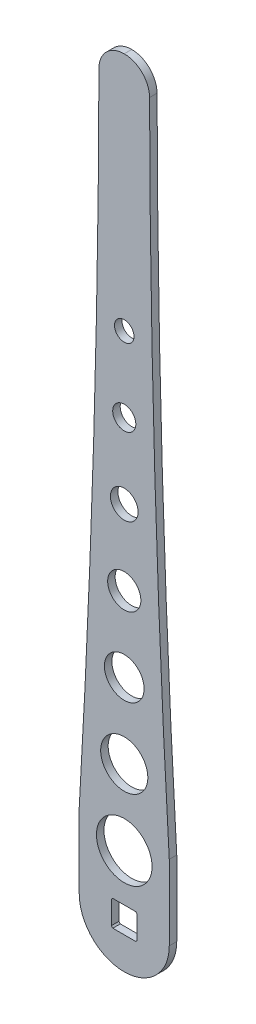
ISO-10303-21;
HEADER;
FILE_DESCRIPTION(('STEP AP214'),'2;1');
FILE_NAME('part.step','',(''),(''),'','','');
FILE_SCHEMA(('AUTOMOTIVE_DESIGN { 1 0 10303 214 1 1 1 1 }'));
ENDSEC;
DATA;
#1=APPLICATION_CONTEXT('core data for automotive mechanical design processes');
#2=APPLICATION_PROTOCOL_DEFINITION('international standard','automotive_design',2000,#1);
#3=PRODUCT_CONTEXT('',#1,'mechanical');
#4=PRODUCT('Part','Part','',(#3));
#5=PRODUCT_RELATED_PRODUCT_CATEGORY('part','',(#4));
#6=PRODUCT_DEFINITION_FORMATION('','',#4);
#7=PRODUCT_DEFINITION_CONTEXT('part definition',#1,'design');
#8=PRODUCT_DEFINITION('design','',#6,#7);
#9=PRODUCT_DEFINITION_SHAPE('','',#8);
#10=(LENGTH_UNIT() NAMED_UNIT(*) SI_UNIT(.MILLI.,.METRE.));
#11=(NAMED_UNIT(*) PLANE_ANGLE_UNIT() SI_UNIT($,.RADIAN.));
#12=(NAMED_UNIT(*) SI_UNIT($,.STERADIAN.) SOLID_ANGLE_UNIT());
#13=UNCERTAINTY_MEASURE_WITH_UNIT(LENGTH_MEASURE(1.E-05),#10,'distance_accuracy_value','');
#14=(GEOMETRIC_REPRESENTATION_CONTEXT(3) GLOBAL_UNCERTAINTY_ASSIGNED_CONTEXT((#13)) GLOBAL_UNIT_ASSIGNED_CONTEXT((#10,
#11,#12)) REPRESENTATION_CONTEXT('',''));
#15=CARTESIAN_POINT('',(0.,0.,0.));
#16=DIRECTION('',(0.,0.,1.));
#17=DIRECTION('',(1.,0.,0.));
#18=AXIS2_PLACEMENT_3D('',#15,#16,#17);
#19=CARTESIAN_POINT('',(-8.6,8.6,-5.));
#20=DIRECTION('',(-1.,0.,0.));
#21=DIRECTION('',(0.,-1.,0.));
#22=AXIS2_PLACEMENT_3D('',#19,#20,#21);
#23=PLANE('',#22);
#24=DIRECTION('',(0.,0.,1.));
#25=VECTOR('',#24,1.);
#26=CARTESIAN_POINT('',(-8.6,-7.63478879865055,-49.424357741048));
#27=LINE('',#26,#25);
#28=CARTESIAN_POINT('',(-8.6,-7.63478879865055,0.));
#29=VERTEX_POINT('',#28);
#30=CARTESIAN_POINT('',(-8.6,-7.63478879865055,5.));
#31=VERTEX_POINT('',#30);
#32=EDGE_CURVE('E256',#29,#31,#27,.T.);
#33=ORIENTED_EDGE('',*,*,#32,.F.);
#34=DIRECTION('',(0.,-1.,0.));
#35=VECTOR('',#34,1.);
#36=CARTESIAN_POINT('',(-8.6,0.,0.));
#37=LINE('',#36,#35);
#38=CARTESIAN_POINT('',(-8.6,7.63478879865055,0.));
#39=VERTEX_POINT('',#38);
#40=EDGE_CURVE('E187',#39,#29,#37,.T.);
#41=ORIENTED_EDGE('',*,*,#40,.F.);
#42=DIRECTION('',(0.,0.,1.));
#43=VECTOR('',#42,1.);
#44=CARTESIAN_POINT('',(-8.6,7.63478879865055,-49.424357741048));
#45=LINE('',#44,#43);
#46=CARTESIAN_POINT('',(-8.6,7.63478879865055,5.));
#47=VERTEX_POINT('',#46);
#48=EDGE_CURVE('E254',#47,#39,#45,.F.);
#49=ORIENTED_EDGE('',*,*,#48,.F.);
#50=DIRECTION('',(0.,-1.,0.));
#51=VECTOR('',#50,1.);
#52=CARTESIAN_POINT('',(-8.6,8.6,5.));
#53=LINE('',#52,#51);
#54=EDGE_CURVE('E258',#47,#31,#53,.T.);
#55=ORIENTED_EDGE('',*,*,#54,.T.);
#56=EDGE_LOOP('',(#33,#41,#49,#55));
#57=FACE_BOUND('',#56,.T.);
#58=ADVANCED_FACE('F41',(#57),#23,.F.);
#59=CARTESIAN_POINT('',(8.6,8.6,-5.));
#60=DIRECTION('',(0.,1.,0.));
#61=DIRECTION('',(-1.,0.,0.));
#62=AXIS2_PLACEMENT_3D('',#59,#60,#61);
#63=PLANE('',#62);
#64=DIRECTION('',(0.,0.,1.));
#65=VECTOR('',#64,1.);
#66=CARTESIAN_POINT('',(-7.63478879865056,8.6,-49.424357741048));
#67=LINE('',#66,#65);
#68=CARTESIAN_POINT('',(-7.63478879865056,8.6,0.));
#69=VERTEX_POINT('',#68);
#70=CARTESIAN_POINT('',(-7.63478879865056,8.6,5.));
#71=VERTEX_POINT('',#70);
#72=EDGE_CURVE('E252',#69,#71,#67,.T.);
#73=ORIENTED_EDGE('',*,*,#72,.F.);
#74=DIRECTION('',(-1.,0.,0.));
#75=VECTOR('',#74,1.);
#76=CARTESIAN_POINT('',(0.,8.6,0.));
#77=LINE('',#76,#75);
#78=CARTESIAN_POINT('',(7.63478879865055,8.6,0.));
#79=VERTEX_POINT('',#78);
#80=EDGE_CURVE('E184',#79,#69,#77,.T.);
#81=ORIENTED_EDGE('',*,*,#80,.F.);
#82=DIRECTION('',(0.,0.,1.));
#83=VECTOR('',#82,1.);
#84=CARTESIAN_POINT('',(7.63478879865055,8.6,-49.424357741048));
#85=LINE('',#84,#83);
#86=CARTESIAN_POINT('',(7.63478879865055,8.6,5.));
#87=VERTEX_POINT('',#86);
#88=EDGE_CURVE('E250',#87,#79,#85,.F.);
#89=ORIENTED_EDGE('',*,*,#88,.F.);
#90=DIRECTION('',(-1.,0.,0.));
#91=VECTOR('',#90,1.);
#92=CARTESIAN_POINT('',(8.6,8.6,5.));
#93=LINE('',#92,#91);
#94=EDGE_CURVE('E266',#87,#71,#93,.T.);
#95=ORIENTED_EDGE('',*,*,#94,.T.);
#96=EDGE_LOOP('',(#73,#81,#89,#95));
#97=FACE_BOUND('',#96,.T.);
#98=ADVANCED_FACE('F350',(#97),#63,.F.);
#99=CARTESIAN_POINT('',(8.6,8.6,-5.));
#100=DIRECTION('',(1.,0.,0.));
#101=DIRECTION('',(0.,1.,0.));
#102=AXIS2_PLACEMENT_3D('',#99,#100,#101);
#103=PLANE('',#102);
#104=DIRECTION('',(0.,0.,1.));
#105=VECTOR('',#104,1.);
#106=CARTESIAN_POINT('',(8.6,7.63478879865056,-49.424357741048));
#107=LINE('',#106,#105);
#108=CARTESIAN_POINT('',(8.6,7.63478879865056,0.));
#109=VERTEX_POINT('',#108);
#110=CARTESIAN_POINT('',(8.6,7.63478879865056,5.));
#111=VERTEX_POINT('',#110);
#112=EDGE_CURVE('E169',#109,#111,#107,.T.);
#113=ORIENTED_EDGE('',*,*,#112,.F.);
#114=DIRECTION('',(0.,1.,0.));
#115=VECTOR('',#114,1.);
#116=CARTESIAN_POINT('',(8.6,0.,0.));
#117=LINE('',#116,#115);
#118=CARTESIAN_POINT('',(8.6,-7.63478879865056,0.));
#119=VERTEX_POINT('',#118);
#120=EDGE_CURVE('E176',#119,#109,#117,.T.);
#121=ORIENTED_EDGE('',*,*,#120,.F.);
#122=DIRECTION('',(0.,0.,1.));
#123=VECTOR('',#122,1.);
#124=CARTESIAN_POINT('',(8.6,-7.63478879865056,-49.424357741048));
#125=LINE('',#124,#123);
#126=CARTESIAN_POINT('',(8.6,-7.63478879865056,5.));
#127=VERTEX_POINT('',#126);
#128=EDGE_CURVE('E158',#127,#119,#125,.F.);
#129=ORIENTED_EDGE('',*,*,#128,.F.);
#130=DIRECTION('',(0.,1.,0.));
#131=VECTOR('',#130,1.);
#132=CARTESIAN_POINT('',(8.6,8.6,5.));
#133=LINE('',#132,#131);
#134=EDGE_CURVE('E264',#127,#111,#133,.T.);
#135=ORIENTED_EDGE('',*,*,#134,.T.);
#136=EDGE_LOOP('',(#113,#121,#129,#135));
#137=FACE_BOUND('',#136,.T.);
#138=ADVANCED_FACE('F183',(#137),#103,.F.);
#139=CARTESIAN_POINT('',(8.6,-8.6,-5.));
#140=DIRECTION('',(0.,-1.,0.));
#141=DIRECTION('',(1.,0.,0.));
#142=AXIS2_PLACEMENT_3D('',#139,#140,#141);
#143=PLANE('',#142);
#144=DIRECTION('',(0.,0.,1.));
#145=VECTOR('',#144,1.);
#146=CARTESIAN_POINT('',(7.63478879865056,-8.6,-49.424357741048));
#147=LINE('',#146,#145);
#148=CARTESIAN_POINT('',(7.63478879865056,-8.6,0.));
#149=VERTEX_POINT('',#148);
#150=CARTESIAN_POINT('',(7.63478879865056,-8.6,5.));
#151=VERTEX_POINT('',#150);
#152=EDGE_CURVE('E198',#149,#151,#147,.T.);
#153=ORIENTED_EDGE('',*,*,#152,.F.);
#154=DIRECTION('',(1.,0.,0.));
#155=VECTOR('',#154,1.);
#156=CARTESIAN_POINT('',(0.,-8.6,0.));
#157=LINE('',#156,#155);
#158=CARTESIAN_POINT('',(-7.63478879865055,-8.6,0.));
#159=VERTEX_POINT('',#158);
#160=EDGE_CURVE('E178',#159,#149,#157,.T.);
#161=ORIENTED_EDGE('',*,*,#160,.F.);
#162=DIRECTION('',(0.,0.,1.));
#163=VECTOR('',#162,1.);
#164=CARTESIAN_POINT('',(-7.63478879865055,-8.6,-49.424357741048));
#165=LINE('',#164,#163);
#166=CARTESIAN_POINT('',(-7.63478879865055,-8.6,5.));
#167=VERTEX_POINT('',#166);
#168=EDGE_CURVE('E195',#167,#159,#165,.F.);
#169=ORIENTED_EDGE('',*,*,#168,.F.);
#170=DIRECTION('',(1.,0.,0.));
#171=VECTOR('',#170,1.);
#172=CARTESIAN_POINT('',(8.6,-8.6,5.));
#173=LINE('',#172,#171);
#174=EDGE_CURVE('E261',#167,#151,#173,.T.);
#175=ORIENTED_EDGE('',*,*,#174,.T.);
#176=EDGE_LOOP('',(#153,#161,#169,#175));
#177=FACE_BOUND('',#176,.T.);
#178=ADVANCED_FACE('F360',(#177),#143,.F.);
#179=CARTESIAN_POINT('',(0.,0.,5.));
#180=DIRECTION('',(0.,0.,-1.));
#181=DIRECTION('',(-1.,0.,0.));
#182=AXIS2_PLACEMENT_3D('',#179,#180,#181);
#183=CYLINDRICAL_SURFACE('',#182,30.);
#184=CARTESIAN_POINT('',(0.,0.,0.));
#185=DIRECTION('',(0.,0.,1.));
#186=DIRECTION('',(1.,0.,0.));
#187=AXIS2_PLACEMENT_3D('',#184,#185,#186);
#188=CIRCLE('',#187,30.);
#189=CARTESIAN_POINT('',(-30.,0.,0.));
#190=VERTEX_POINT('',#189);
#191=CARTESIAN_POINT('',(30.,0.,0.));
#192=VERTEX_POINT('',#191);
#193=EDGE_CURVE('E269',#190,#192,#188,.T.);
#194=ORIENTED_EDGE('',*,*,#193,.T.);
#195=DIRECTION('',(0.,0.,-1.));
#196=VECTOR('',#195,1.);
#197=CARTESIAN_POINT('',(30.,0.,5.));
#198=LINE('',#197,#196);
#199=CARTESIAN_POINT('',(30.,0.,5.));
#200=VERTEX_POINT('',#199);
#201=EDGE_CURVE('E189',#200,#192,#198,.T.);
#202=ORIENTED_EDGE('',*,*,#201,.F.);
#203=CARTESIAN_POINT('',(0.,0.,5.));
#204=DIRECTION('',(0.,0.,1.));
#205=DIRECTION('',(1.,0.,0.));
#206=AXIS2_PLACEMENT_3D('',#203,#204,#205);
#207=CIRCLE('',#206,30.);
#208=CARTESIAN_POINT('',(-30.,0.,5.));
#209=VERTEX_POINT('',#208);
#210=EDGE_CURVE('E270',#209,#200,#207,.T.);
#211=ORIENTED_EDGE('',*,*,#210,.F.);
#212=DIRECTION('',(0.,0.,-1.));
#213=VECTOR('',#212,1.);
#214=CARTESIAN_POINT('',(-30.,0.,5.));
#215=LINE('',#214,#213);
#216=EDGE_CURVE('E284',#209,#190,#215,.T.);
#217=ORIENTED_EDGE('',*,*,#216,.T.);
#218=EDGE_LOOP('',(#194,#202,#211,#217));
#219=FACE_BOUND('',#218,.T.);
#220=ADVANCED_FACE('F312',(#219),#183,.T.);
#221=CARTESIAN_POINT('',(30.,0.,5.));
#222=DIRECTION('',(-1.,0.,0.));
#223=DIRECTION('',(0.,0.,1.));
#224=AXIS2_PLACEMENT_3D('',#221,#222,#223);
#225=PLANE('',#224);
#226=DIRECTION('',(0.,1.,0.));
#227=VECTOR('',#226,1.);
#228=CARTESIAN_POINT('',(30.,0.,0.));
#229=LINE('',#228,#227);
#230=CARTESIAN_POINT('',(29.9999999999994,50.0000000000009,0.));
#231=VERTEX_POINT('',#230);
#232=EDGE_CURVE('E287',#192,#231,#229,.T.);
#233=ORIENTED_EDGE('',*,*,#232,.T.);
#234=DIRECTION('',(0.,0.,-1.));
#235=VECTOR('',#234,1.);
#236=CARTESIAN_POINT('',(29.9999999999994,50.0000000000009,5.));
#237=LINE('',#236,#235);
#238=CARTESIAN_POINT('',(29.9999999999994,50.0000000000009,5.));
#239=VERTEX_POINT('',#238);
#240=EDGE_CURVE('E302',#239,#231,#237,.T.);
#241=ORIENTED_EDGE('',*,*,#240,.F.);
#242=DIRECTION('',(0.,1.,0.));
#243=VECTOR('',#242,1.);
#244=CARTESIAN_POINT('',(30.,0.,5.));
#245=LINE('',#244,#243);
#246=EDGE_CURVE('E273',#200,#239,#245,.T.);
#247=ORIENTED_EDGE('',*,*,#246,.F.);
#248=ORIENTED_EDGE('',*,*,#201,.T.);
#249=EDGE_LOOP('',(#233,#241,#247,#248));
#250=FACE_BOUND('',#249,.T.);
#251=ADVANCED_FACE('F307',(#250),#225,.F.);
#252=CARTESIAN_POINT('',(7723.04477186312,500.,5.));
#253=DIRECTION('',(0.,0.,-1.));
#254=DIRECTION('',(-1.,0.,0.));
#255=AXIS2_PLACEMENT_3D('',#252,#253,#254);
#256=CYLINDRICAL_SURFACE('',#255,7706.19477186312);
#257=CARTESIAN_POINT('',(7723.04477186312,500.,0.));
#258=DIRECTION('',(0.,0.,-1.));
#259=DIRECTION('',(-1.,0.,0.));
#260=AXIS2_PLACEMENT_3D('',#257,#258,#259);
#261=CIRCLE('',#260,7706.19477186312);
#262=CARTESIAN_POINT('',(16.8683414306479,483.186763026551,0.));
#263=VERTEX_POINT('',#262);
#264=EDGE_CURVE('E289',#231,#263,#261,.T.);
#265=ORIENTED_EDGE('',*,*,#264,.T.);
#266=DIRECTION('',(0.,0.,-1.));
#267=VECTOR('',#266,1.);
#268=CARTESIAN_POINT('',(16.8683414306461,483.186763026551,5.));
#269=LINE('',#268,#267);
#270=CARTESIAN_POINT('',(16.8683414306479,483.186763026551,5.));
#271=VERTEX_POINT('',#270);
#272=EDGE_CURVE('E66',#263,#271,#269,.F.);
#273=ORIENTED_EDGE('',*,*,#272,.T.);
#274=CARTESIAN_POINT('',(7723.04477186312,500.,5.));
#275=DIRECTION('',(0.,0.,-1.));
#276=DIRECTION('',(-1.,0.,0.));
#277=AXIS2_PLACEMENT_3D('',#274,#275,#276);
#278=CIRCLE('',#277,7706.19477186312);
#279=EDGE_CURVE('E276',#239,#271,#278,.T.);
#280=ORIENTED_EDGE('',*,*,#279,.F.);
#281=ORIENTED_EDGE('',*,*,#240,.T.);
#282=EDGE_LOOP('',(#265,#273,#280,#281));
#283=FACE_BOUND('',#282,.T.);
#284=ADVANCED_FACE('F319',(#283),#256,.F.);
#285=CARTESIAN_POINT('',(-16.8499999999998,500.,5.));
#286=DIRECTION('',(0.,-1.,0.));
#287=DIRECTION('',(0.,0.,-1.));
#288=AXIS2_PLACEMENT_3D('',#285,#286,#287);
#289=PLANE('',#288);
#290=DIRECTION('',(-1.,0.,0.));
#291=VECTOR('',#290,1.);
#292=CARTESIAN_POINT('',(-16.8499999999998,500.,5.));
#293=LINE('',#292,#291);
#294=CARTESIAN_POINT('',(0.0183815351508798,500.,5.));
#295=VERTEX_POINT('',#294);
#296=CARTESIAN_POINT('',(-0.0183815351508798,500.,5.));
#297=VERTEX_POINT('',#296);
#298=EDGE_CURVE('E278',#295,#297,#293,.T.);
#299=ORIENTED_EDGE('',*,*,#298,.F.);
#300=DIRECTION('',(0.,0.,-1.));
#301=VECTOR('',#300,1.);
#302=CARTESIAN_POINT('',(0.0183815351508798,500.,5.));
#303=LINE('',#302,#301);
#304=CARTESIAN_POINT('',(0.0183815351508798,500.,0.));
#305=VERTEX_POINT('',#304);
#306=EDGE_CURVE('E202',#295,#305,#303,.T.);
#307=ORIENTED_EDGE('',*,*,#306,.T.);
#308=DIRECTION('',(-1.,0.,0.));
#309=VECTOR('',#308,1.);
#310=CARTESIAN_POINT('',(-16.8499999999998,500.,0.));
#311=LINE('',#310,#309);
#312=CARTESIAN_POINT('',(-0.0183815351508798,500.,0.));
#313=VERTEX_POINT('',#312);
#314=EDGE_CURVE('E291',#305,#313,#311,.T.);
#315=ORIENTED_EDGE('',*,*,#314,.T.);
#316=DIRECTION('',(0.,0.,-1.));
#317=VECTOR('',#316,1.);
#318=CARTESIAN_POINT('',(-0.0183815351508798,500.,5.));
#319=LINE('',#318,#317);
#320=EDGE_CURVE('E200',#313,#297,#319,.F.);
#321=ORIENTED_EDGE('',*,*,#320,.T.);
#322=EDGE_LOOP('',(#299,#307,#315,#321));
#323=FACE_BOUND('',#322,.T.);
#324=ADVANCED_FACE('F328',(#323),#289,.F.);
#325=CARTESIAN_POINT('',(-7723.04477186312,500.,5.));
#326=DIRECTION('',(0.,0.,-1.));
#327=DIRECTION('',(-1.,0.,0.));
#328=AXIS2_PLACEMENT_3D('',#325,#326,#327);
#329=CYLINDRICAL_SURFACE('',#328,7706.19477186312);
#330=CARTESIAN_POINT('',(-7723.04477186312,500.,5.));
#331=DIRECTION('',(0.,0.,-1.));
#332=DIRECTION('',(1.,0.,0.));
#333=AXIS2_PLACEMENT_3D('',#330,#331,#332);
#334=CIRCLE('',#333,7706.19477186312);
#335=CARTESIAN_POINT('',(-16.8683414306479,483.186763026551,5.));
#336=VERTEX_POINT('',#335);
#337=CARTESIAN_POINT('',(-30.,50.,5.));
#338=VERTEX_POINT('',#337);
#339=EDGE_CURVE('E280',#336,#338,#334,.T.);
#340=ORIENTED_EDGE('',*,*,#339,.F.);
#341=DIRECTION('',(0.,0.,-1.));
#342=VECTOR('',#341,1.);
#343=CARTESIAN_POINT('',(-16.8683414306461,483.186763026551,5.));
#344=LINE('',#343,#342);
#345=CARTESIAN_POINT('',(-16.8683414306479,483.186763026551,0.));
#346=VERTEX_POINT('',#345);
#347=EDGE_CURVE('E11',#336,#346,#344,.T.);
#348=ORIENTED_EDGE('',*,*,#347,.T.);
#349=CARTESIAN_POINT('',(-7723.04477186312,500.,0.));
#350=DIRECTION('',(0.,0.,-1.));
#351=DIRECTION('',(1.,0.,0.));
#352=AXIS2_PLACEMENT_3D('',#349,#350,#351);
#353=CIRCLE('',#352,7706.19477186312);
#354=CARTESIAN_POINT('',(-30.,50.,0.));
#355=VERTEX_POINT('',#354);
#356=EDGE_CURVE('E294',#346,#355,#353,.T.);
#357=ORIENTED_EDGE('',*,*,#356,.T.);
#358=DIRECTION('',(0.,0.,-1.));
#359=VECTOR('',#358,1.);
#360=CARTESIAN_POINT('',(-30.,50.,5.));
#361=LINE('',#360,#359);
#362=EDGE_CURVE('E299',#338,#355,#361,.T.);
#363=ORIENTED_EDGE('',*,*,#362,.F.);
#364=EDGE_LOOP('',(#340,#348,#357,#363));
#365=FACE_BOUND('',#364,.T.);
#366=ADVANCED_FACE('F333',(#365),#329,.F.);
#367=CARTESIAN_POINT('',(-30.,0.,5.));
#368=DIRECTION('',(1.,0.,0.));
#369=DIRECTION('',(0.,0.,-1.));
#370=AXIS2_PLACEMENT_3D('',#367,#368,#369);
#371=PLANE('',#370);
#372=DIRECTION('',(0.,-1.,0.));
#373=VECTOR('',#372,1.);
#374=CARTESIAN_POINT('',(-30.,0.,0.));
#375=LINE('',#374,#373);
#376=EDGE_CURVE('E274',#355,#190,#375,.T.);
#377=ORIENTED_EDGE('',*,*,#376,.T.);
#378=ORIENTED_EDGE('',*,*,#216,.F.);
#379=DIRECTION('',(0.,-1.,0.));
#380=VECTOR('',#379,1.);
#381=CARTESIAN_POINT('',(-30.,0.,5.));
#382=LINE('',#381,#380);
#383=EDGE_CURVE('E282',#338,#209,#382,.T.);
#384=ORIENTED_EDGE('',*,*,#383,.F.);
#385=ORIENTED_EDGE('',*,*,#362,.T.);
#386=EDGE_LOOP('',(#377,#378,#384,#385));
#387=FACE_BOUND('',#386,.T.);
#388=ADVANCED_FACE('F337',(#387),#371,.F.);
#389=CARTESIAN_POINT('',(0.,0.,5.));
#390=DIRECTION('',(0.,0.,1.));
#391=DIRECTION('',(1.,0.,0.));
#392=AXIS2_PLACEMENT_3D('',#389,#390,#391);
#393=PLANE('',#392);
#394=CARTESIAN_POINT('',(0.,140.,5.));
#395=DIRECTION('',(0.,0.,1.));
#396=DIRECTION('',(1.,0.,0.));
#397=AXIS2_PLACEMENT_3D('',#394,#395,#396);
#398=CIRCLE('',#397,13.2359203310664);
#399=CARTESIAN_POINT('',(13.2359203310664,140.,5.));
#400=VERTEX_POINT('',#399);
#401=EDGE_CURVE('E224',#400,#400,#398,.T.);
#402=ORIENTED_EDGE('',*,*,#401,.F.);
#403=EDGE_LOOP('',(#402));
#404=FACE_BOUND('',#403,.T.);
#405=CARTESIAN_POINT('',(0.,190.,5.));
#406=DIRECTION('',(0.,0.,1.));
#407=DIRECTION('',(1.,0.,0.));
#408=AXIS2_PLACEMENT_3D('',#405,#406,#407);
#409=CIRCLE('',#408,11.0691354052985);
#410=CARTESIAN_POINT('',(11.0691354052985,190.,5.));
#411=VERTEX_POINT('',#410);
#412=EDGE_CURVE('E630',#411,#411,#409,.T.);
#413=ORIENTED_EDGE('',*,*,#412,.F.);
#414=EDGE_LOOP('',(#413));
#415=FACE_BOUND('',#414,.T.);
#416=CARTESIAN_POINT('',(0.,240.,5.));
#417=DIRECTION('',(0.,0.,1.));
#418=DIRECTION('',(1.,0.,0.));
#419=AXIS2_PLACEMENT_3D('',#416,#417,#418);
#420=CIRCLE('',#419,9.22527289970265);
#421=CARTESIAN_POINT('',(9.22527289970265,240.,5.));
#422=VERTEX_POINT('',#421);
#423=EDGE_CURVE('E633',#422,#422,#420,.T.);
#424=ORIENTED_EDGE('',*,*,#423,.F.);
#425=EDGE_LOOP('',(#424));
#426=FACE_BOUND('',#425,.T.);
#427=CARTESIAN_POINT('',(0.,290.,5.));
#428=DIRECTION('',(0.,0.,1.));
#429=DIRECTION('',(1.,0.,0.));
#430=AXIS2_PLACEMENT_3D('',#427,#428,#429);
#431=CIRCLE('',#430,7.70456402019626);
#432=CARTESIAN_POINT('',(7.70456402019626,290.,5.));
#433=VERTEX_POINT('',#432);
#434=EDGE_CURVE('E637',#433,#433,#431,.T.);
#435=ORIENTED_EDGE('',*,*,#434,.F.);
#436=EDGE_LOOP('',(#435));
#437=FACE_BOUND('',#436,.T.);
#438=CARTESIAN_POINT('',(0.,340.,5.));
#439=DIRECTION('',(0.,0.,1.));
#440=DIRECTION('',(1.,0.,0.));
#441=AXIS2_PLACEMENT_3D('',#438,#439,#440);
#442=CIRCLE('',#441,6.50719961786983);
#443=CARTESIAN_POINT('',(6.50719961786983,340.,5.));
#444=VERTEX_POINT('',#443);
#445=EDGE_CURVE('E242',#444,#444,#442,.T.);
#446=ORIENTED_EDGE('',*,*,#445,.F.);
#447=EDGE_LOOP('',(#446));
#448=FACE_BOUND('',#447,.T.);
#449=CARTESIAN_POINT('',(0.,90.,5.));
#450=DIRECTION('',(0.,0.,1.));
#451=DIRECTION('',(1.,0.,0.));
#452=AXIS2_PLACEMENT_3D('',#449,#450,#451);
#453=CIRCLE('',#452,15.7253562609263);
#454=CARTESIAN_POINT('',(15.7253562609263,90.,5.));
#455=VERTEX_POINT('',#454);
#456=EDGE_CURVE('E219',#455,#455,#453,.T.);
#457=ORIENTED_EDGE('',*,*,#456,.F.);
#458=EDGE_LOOP('',(#457));
#459=FACE_BOUND('',#458,.T.);
#460=CARTESIAN_POINT('',(0.,40.,5.));
#461=DIRECTION('',(0.,0.,1.));
#462=DIRECTION('',(1.,0.,0.));
#463=AXIS2_PLACEMENT_3D('',#460,#461,#462);
#464=CIRCLE('',#463,18.5371317381859);
#465=CARTESIAN_POINT('',(18.5371317381859,40.,5.));
#466=VERTEX_POINT('',#465);
#467=EDGE_CURVE('E215',#466,#466,#464,.T.);
#468=ORIENTED_EDGE('',*,*,#467,.F.);
#469=EDGE_LOOP('',(#468));
#470=FACE_BOUND('',#469,.T.);
#471=ORIENTED_EDGE('',*,*,#279,.T.);
#472=CARTESIAN_POINT('',(0.0183815351508798,483.15,5.));
#473=DIRECTION('',(0.,0.,1.));
#474=DIRECTION('',(1.,0.,0.));
#475=AXIS2_PLACEMENT_3D('',#472,#473,#474);
#476=CIRCLE('',#475,16.85);
#477=EDGE_CURVE('E50',#271,#295,#476,.T.);
#478=ORIENTED_EDGE('',*,*,#477,.T.);
#479=ORIENTED_EDGE('',*,*,#298,.T.);
#480=CARTESIAN_POINT('',(-0.0183815351508798,483.15,5.));
#481=DIRECTION('',(0.,0.,1.));
#482=DIRECTION('',(1.,0.,0.));
#483=AXIS2_PLACEMENT_3D('',#480,#481,#482);
#484=CIRCLE('',#483,16.85);
#485=EDGE_CURVE('E58',#297,#336,#484,.T.);
#486=ORIENTED_EDGE('',*,*,#485,.T.);
#487=ORIENTED_EDGE('',*,*,#339,.T.);
#488=ORIENTED_EDGE('',*,*,#383,.T.);
#489=ORIENTED_EDGE('',*,*,#210,.T.);
#490=ORIENTED_EDGE('',*,*,#246,.T.);
#491=EDGE_LOOP('',(#471,#478,#479,#486,#487,#488,#489,#490));
#492=FACE_BOUND('',#491,.T.);
#493=ORIENTED_EDGE('',*,*,#134,.F.);
#494=CARTESIAN_POINT('',(0.,0.,5.));
#495=DIRECTION('',(0.,0.,1.));
#496=DIRECTION('',(1.,0.,0.));
#497=AXIS2_PLACEMENT_3D('',#494,#495,#496);
#498=CIRCLE('',#497,11.5);
#499=EDGE_CURVE('E164',#151,#127,#498,.T.);
#500=ORIENTED_EDGE('',*,*,#499,.F.);
#501=ORIENTED_EDGE('',*,*,#174,.F.);
#502=EDGE_CURVE('E407',#31,#167,#498,.T.);
#503=ORIENTED_EDGE('',*,*,#502,.F.);
#504=ORIENTED_EDGE('',*,*,#54,.F.);
#505=EDGE_CURVE('E247',#71,#47,#498,.T.);
#506=ORIENTED_EDGE('',*,*,#505,.F.);
#507=ORIENTED_EDGE('',*,*,#94,.F.);
#508=EDGE_CURVE('E246',#111,#87,#498,.T.);
#509=ORIENTED_EDGE('',*,*,#508,.F.);
#510=EDGE_LOOP('',(#493,#500,#501,#503,#504,#506,#507,#509));
#511=FACE_BOUND('',#510,.T.);
#512=ADVANCED_FACE('F325',(#404,#415,#426,#437,#448,#459,#470,#492,#511),#393,.T.);
#513=CARTESIAN_POINT('',(0.,0.,0.));
#514=DIRECTION('',(0.,0.,1.));
#515=DIRECTION('',(1.,0.,0.));
#516=AXIS2_PLACEMENT_3D('',#513,#514,#515);
#517=PLANE('',#516);
#518=CARTESIAN_POINT('',(0.,140.,0.));
#519=DIRECTION('',(0.,0.,1.));
#520=DIRECTION('',(1.,0.,0.));
#521=AXIS2_PLACEMENT_3D('',#518,#519,#520);
#522=CIRCLE('',#521,13.2359203310664);
#523=CARTESIAN_POINT('',(13.2359203310664,140.,0.));
#524=VERTEX_POINT('',#523);
#525=EDGE_CURVE('E45',#524,#524,#522,.T.);
#526=ORIENTED_EDGE('',*,*,#525,.T.);
#527=EDGE_LOOP('',(#526));
#528=FACE_BOUND('',#527,.T.);
#529=CARTESIAN_POINT('',(0.,190.,0.));
#530=DIRECTION('',(0.,0.,1.));
#531=DIRECTION('',(1.,0.,0.));
#532=AXIS2_PLACEMENT_3D('',#529,#530,#531);
#533=CIRCLE('',#532,11.0691354052985);
#534=CARTESIAN_POINT('',(11.0691354052985,190.,0.));
#535=VERTEX_POINT('',#534);
#536=EDGE_CURVE('E229',#535,#535,#533,.T.);
#537=ORIENTED_EDGE('',*,*,#536,.T.);
#538=EDGE_LOOP('',(#537));
#539=FACE_BOUND('',#538,.T.);
#540=CARTESIAN_POINT('',(0.,240.,0.));
#541=DIRECTION('',(0.,0.,1.));
#542=DIRECTION('',(1.,0.,0.));
#543=AXIS2_PLACEMENT_3D('',#540,#541,#542);
#544=CIRCLE('',#543,9.22527289970265);
#545=CARTESIAN_POINT('',(9.22527289970265,240.,0.));
#546=VERTEX_POINT('',#545);
#547=EDGE_CURVE('E227',#546,#546,#544,.T.);
#548=ORIENTED_EDGE('',*,*,#547,.T.);
#549=EDGE_LOOP('',(#548));
#550=FACE_BOUND('',#549,.T.);
#551=CARTESIAN_POINT('',(0.,290.,0.));
#552=DIRECTION('',(0.,0.,1.));
#553=DIRECTION('',(1.,0.,0.));
#554=AXIS2_PLACEMENT_3D('',#551,#552,#553);
#555=CIRCLE('',#554,7.70456402019626);
#556=CARTESIAN_POINT('',(7.70456402019626,290.,0.));
#557=VERTEX_POINT('',#556);
#558=EDGE_CURVE('E223',#557,#557,#555,.T.);
#559=ORIENTED_EDGE('',*,*,#558,.T.);
#560=EDGE_LOOP('',(#559));
#561=FACE_BOUND('',#560,.T.);
#562=CARTESIAN_POINT('',(0.,340.,0.));
#563=DIRECTION('',(0.,0.,1.));
#564=DIRECTION('',(1.,0.,0.));
#565=AXIS2_PLACEMENT_3D('',#562,#563,#564);
#566=CIRCLE('',#565,6.50719961786983);
#567=CARTESIAN_POINT('',(6.50719961786983,340.,0.));
#568=VERTEX_POINT('',#567);
#569=EDGE_CURVE('E220',#568,#568,#566,.T.);
#570=ORIENTED_EDGE('',*,*,#569,.T.);
#571=EDGE_LOOP('',(#570));
#572=FACE_BOUND('',#571,.T.);
#573=CARTESIAN_POINT('',(0.,90.,0.));
#574=DIRECTION('',(0.,0.,1.));
#575=DIRECTION('',(1.,0.,0.));
#576=AXIS2_PLACEMENT_3D('',#573,#574,#575);
#577=CIRCLE('',#576,15.7253562609263);
#578=CARTESIAN_POINT('',(15.7253562609263,90.,0.));
#579=VERTEX_POINT('',#578);
#580=EDGE_CURVE('E216',#579,#579,#577,.T.);
#581=ORIENTED_EDGE('',*,*,#580,.T.);
#582=EDGE_LOOP('',(#581));
#583=FACE_BOUND('',#582,.T.);
#584=CARTESIAN_POINT('',(0.,40.,0.));
#585=DIRECTION('',(0.,0.,1.));
#586=DIRECTION('',(1.,0.,0.));
#587=AXIS2_PLACEMENT_3D('',#584,#585,#586);
#588=CIRCLE('',#587,18.5371317381859);
#589=CARTESIAN_POINT('',(18.5371317381859,40.,0.));
#590=VERTEX_POINT('',#589);
#591=EDGE_CURVE('E212',#590,#590,#588,.T.);
#592=ORIENTED_EDGE('',*,*,#591,.T.);
#593=EDGE_LOOP('',(#592));
#594=FACE_BOUND('',#593,.T.);
#595=ORIENTED_EDGE('',*,*,#314,.F.);
#596=CARTESIAN_POINT('',(0.0183815351508798,483.15,0.));
#597=DIRECTION('',(0.,0.,1.));
#598=DIRECTION('',(1.,0.,0.));
#599=AXIS2_PLACEMENT_3D('',#596,#597,#598);
#600=CIRCLE('',#599,16.85);
#601=EDGE_CURVE('E207',#305,#263,#600,.F.);
#602=ORIENTED_EDGE('',*,*,#601,.T.);
#603=ORIENTED_EDGE('',*,*,#264,.F.);
#604=ORIENTED_EDGE('',*,*,#232,.F.);
#605=ORIENTED_EDGE('',*,*,#193,.F.);
#606=ORIENTED_EDGE('',*,*,#376,.F.);
#607=ORIENTED_EDGE('',*,*,#356,.F.);
#608=CARTESIAN_POINT('',(-0.0183815351508798,483.15,0.));
#609=DIRECTION('',(0.,0.,1.));
#610=DIRECTION('',(1.,0.,0.));
#611=AXIS2_PLACEMENT_3D('',#608,#609,#610);
#612=CIRCLE('',#611,16.85);
#613=EDGE_CURVE('E205',#346,#313,#612,.F.);
#614=ORIENTED_EDGE('',*,*,#613,.T.);
#615=EDGE_LOOP('',(#595,#602,#603,#604,#605,#606,#607,#614));
#616=FACE_BOUND('',#615,.T.);
#617=ORIENTED_EDGE('',*,*,#120,.T.);
#618=CARTESIAN_POINT('',(0.,0.,0.));
#619=DIRECTION('',(0.,0.,1.));
#620=DIRECTION('',(1.,0.,0.));
#621=AXIS2_PLACEMENT_3D('',#618,#619,#620);
#622=CIRCLE('',#621,11.5);
#623=EDGE_CURVE('E181',#79,#109,#622,.F.);
#624=ORIENTED_EDGE('',*,*,#623,.F.);
#625=ORIENTED_EDGE('',*,*,#80,.T.);
#626=EDGE_CURVE('E416',#39,#69,#622,.F.);
#627=ORIENTED_EDGE('',*,*,#626,.F.);
#628=ORIENTED_EDGE('',*,*,#40,.T.);
#629=EDGE_CURVE('E179',#159,#29,#622,.F.);
#630=ORIENTED_EDGE('',*,*,#629,.F.);
#631=ORIENTED_EDGE('',*,*,#160,.T.);
#632=EDGE_CURVE('E161',#119,#149,#622,.F.);
#633=ORIENTED_EDGE('',*,*,#632,.F.);
#634=EDGE_LOOP('',(#617,#624,#625,#627,#628,#630,#631,#633));
#635=FACE_BOUND('',#634,.T.);
#636=ADVANCED_FACE('F174',(#528,#539,#550,#561,#572,#583,#594,#616,#635),#517,.F.);
#637=CARTESIAN_POINT('',(0.,0.,-49.424357741048));
#638=DIRECTION('',(0.,0.,1.));
#639=DIRECTION('',(1.,0.,0.));
#640=AXIS2_PLACEMENT_3D('',#637,#638,#639);
#641=CYLINDRICAL_SURFACE('',#640,11.5);
#642=ORIENTED_EDGE('',*,*,#629,.T.);
#643=ORIENTED_EDGE('',*,*,#32,.T.);
#644=ORIENTED_EDGE('',*,*,#502,.T.);
#645=ORIENTED_EDGE('',*,*,#168,.T.);
#646=EDGE_LOOP('',(#642,#643,#644,#645));
#647=FACE_BOUND('',#646,.T.);
#648=ADVANCED_FACE('F363',(#647),#641,.F.);
#649=ORIENTED_EDGE('',*,*,#499,.T.);
#650=ORIENTED_EDGE('',*,*,#128,.T.);
#651=ORIENTED_EDGE('',*,*,#632,.T.);
#652=ORIENTED_EDGE('',*,*,#152,.T.);
#653=EDGE_LOOP('',(#649,#650,#651,#652));
#654=FACE_BOUND('',#653,.T.);
#655=ADVANCED_FACE('F160',(#654),#641,.F.);
#656=ORIENTED_EDGE('',*,*,#508,.T.);
#657=ORIENTED_EDGE('',*,*,#88,.T.);
#658=ORIENTED_EDGE('',*,*,#623,.T.);
#659=ORIENTED_EDGE('',*,*,#112,.T.);
#660=EDGE_LOOP('',(#656,#657,#658,#659));
#661=FACE_BOUND('',#660,.T.);
#662=ADVANCED_FACE('F419',(#661),#641,.F.);
#663=ORIENTED_EDGE('',*,*,#505,.T.);
#664=ORIENTED_EDGE('',*,*,#48,.T.);
#665=ORIENTED_EDGE('',*,*,#626,.T.);
#666=ORIENTED_EDGE('',*,*,#72,.T.);
#667=EDGE_LOOP('',(#663,#664,#665,#666));
#668=FACE_BOUND('',#667,.T.);
#669=ADVANCED_FACE('F370',(#668),#641,.F.);
#670=CARTESIAN_POINT('',(0.0183815351508798,483.15,5.));
#671=DIRECTION('',(0.,0.,-1.));
#672=DIRECTION('',(-1.,0.,0.));
#673=AXIS2_PLACEMENT_3D('',#670,#671,#672);
#674=CYLINDRICAL_SURFACE('',#673,16.85);
#675=ORIENTED_EDGE('',*,*,#477,.F.);
#676=ORIENTED_EDGE('',*,*,#272,.F.);
#677=ORIENTED_EDGE('',*,*,#601,.F.);
#678=ORIENTED_EDGE('',*,*,#306,.F.);
#679=EDGE_LOOP('',(#675,#676,#677,#678));
#680=FACE_BOUND('',#679,.T.);
#681=ADVANCED_FACE('F322',(#680),#674,.T.);
#682=CARTESIAN_POINT('',(-0.0183815351508798,483.15,5.));
#683=DIRECTION('',(0.,0.,-1.));
#684=DIRECTION('',(-1.,0.,0.));
#685=AXIS2_PLACEMENT_3D('',#682,#683,#684);
#686=CYLINDRICAL_SURFACE('',#685,16.85);
#687=ORIENTED_EDGE('',*,*,#485,.F.);
#688=ORIENTED_EDGE('',*,*,#320,.F.);
#689=ORIENTED_EDGE('',*,*,#613,.F.);
#690=ORIENTED_EDGE('',*,*,#347,.F.);
#691=EDGE_LOOP('',(#687,#688,#689,#690));
#692=FACE_BOUND('',#691,.T.);
#693=ADVANCED_FACE('F43',(#692),#686,.T.);
#694=CARTESIAN_POINT('',(0.,40.,-5.));
#695=DIRECTION('',(0.,0.,1.));
#696=DIRECTION('',(1.,0.,0.));
#697=AXIS2_PLACEMENT_3D('',#694,#695,#696);
#698=CYLINDRICAL_SURFACE('',#697,18.5371317381859);
#699=ORIENTED_EDGE('',*,*,#467,.T.);
#700=EDGE_LOOP('',(#699));
#701=FACE_BOUND('',#700,.T.);
#702=ORIENTED_EDGE('',*,*,#591,.F.);
#703=EDGE_LOOP('',(#702));
#704=FACE_BOUND('',#703,.T.);
#705=ADVANCED_FACE('F382',(#701,#704),#698,.F.);
#706=CARTESIAN_POINT('',(0.,90.,-5.));
#707=DIRECTION('',(0.,0.,1.));
#708=DIRECTION('',(1.,0.,0.));
#709=AXIS2_PLACEMENT_3D('',#706,#707,#708);
#710=CYLINDRICAL_SURFACE('',#709,15.7253562609263);
#711=ORIENTED_EDGE('',*,*,#456,.T.);
#712=EDGE_LOOP('',(#711));
#713=FACE_BOUND('',#712,.T.);
#714=ORIENTED_EDGE('',*,*,#580,.F.);
#715=EDGE_LOOP('',(#714));
#716=FACE_BOUND('',#715,.T.);
#717=ADVANCED_FACE('F384',(#713,#716),#710,.F.);
#718=CARTESIAN_POINT('',(0.,340.,-5.));
#719=DIRECTION('',(0.,0.,1.));
#720=DIRECTION('',(1.,0.,0.));
#721=AXIS2_PLACEMENT_3D('',#718,#719,#720);
#722=CYLINDRICAL_SURFACE('',#721,6.50719961786983);
#723=ORIENTED_EDGE('',*,*,#445,.T.);
#724=EDGE_LOOP('',(#723));
#725=FACE_BOUND('',#724,.T.);
#726=ORIENTED_EDGE('',*,*,#569,.F.);
#727=EDGE_LOOP('',(#726));
#728=FACE_BOUND('',#727,.T.);
#729=ADVANCED_FACE('F391',(#725,#728),#722,.F.);
#730=CARTESIAN_POINT('',(0.,290.,-5.));
#731=DIRECTION('',(0.,0.,1.));
#732=DIRECTION('',(1.,0.,0.));
#733=AXIS2_PLACEMENT_3D('',#730,#731,#732);
#734=CYLINDRICAL_SURFACE('',#733,7.70456402019626);
#735=ORIENTED_EDGE('',*,*,#434,.T.);
#736=EDGE_LOOP('',(#735));
#737=FACE_BOUND('',#736,.T.);
#738=ORIENTED_EDGE('',*,*,#558,.F.);
#739=EDGE_LOOP('',(#738));
#740=FACE_BOUND('',#739,.T.);
#741=ADVANCED_FACE('F584',(#737,#740),#734,.F.);
#742=CARTESIAN_POINT('',(0.,240.,-5.));
#743=DIRECTION('',(0.,0.,1.));
#744=DIRECTION('',(1.,0.,0.));
#745=AXIS2_PLACEMENT_3D('',#742,#743,#744);
#746=CYLINDRICAL_SURFACE('',#745,9.22527289970265);
#747=ORIENTED_EDGE('',*,*,#423,.T.);
#748=EDGE_LOOP('',(#747));
#749=FACE_BOUND('',#748,.T.);
#750=ORIENTED_EDGE('',*,*,#547,.F.);
#751=EDGE_LOOP('',(#750));
#752=FACE_BOUND('',#751,.T.);
#753=ADVANCED_FACE('F592',(#749,#752),#746,.F.);
#754=CARTESIAN_POINT('',(0.,190.,-5.));
#755=DIRECTION('',(0.,0.,1.));
#756=DIRECTION('',(1.,0.,0.));
#757=AXIS2_PLACEMENT_3D('',#754,#755,#756);
#758=CYLINDRICAL_SURFACE('',#757,11.0691354052985);
#759=ORIENTED_EDGE('',*,*,#412,.T.);
#760=EDGE_LOOP('',(#759));
#761=FACE_BOUND('',#760,.T.);
#762=ORIENTED_EDGE('',*,*,#536,.F.);
#763=EDGE_LOOP('',(#762));
#764=FACE_BOUND('',#763,.T.);
#765=ADVANCED_FACE('F601',(#761,#764),#758,.F.);
#766=CARTESIAN_POINT('',(0.,140.,-5.));
#767=DIRECTION('',(0.,0.,1.));
#768=DIRECTION('',(1.,0.,0.));
#769=AXIS2_PLACEMENT_3D('',#766,#767,#768);
#770=CYLINDRICAL_SURFACE('',#769,13.2359203310664);
#771=ORIENTED_EDGE('',*,*,#401,.T.);
#772=EDGE_LOOP('',(#771));
#773=FACE_BOUND('',#772,.T.);
#774=ORIENTED_EDGE('',*,*,#525,.F.);
#775=EDGE_LOOP('',(#774));
#776=FACE_BOUND('',#775,.T.);
#777=ADVANCED_FACE('F610',(#773,#776),#770,.F.);
#778=CLOSED_SHELL('',(#58,#98,#138,#178,#220,#251,#284,#324,#366,#388,#512,#636,#648,#655,#662,
#669,#681,#693,#705,#717,#729,#741,#753,#765,#777));
#779=MANIFOLD_SOLID_BREP('B2',#778);
#780=ADVANCED_BREP_SHAPE_REPRESENTATION('',(#18,#779),#14);
#781=SHAPE_DEFINITION_REPRESENTATION(#9,#780);
ENDSEC;
END-ISO-10303-21;
